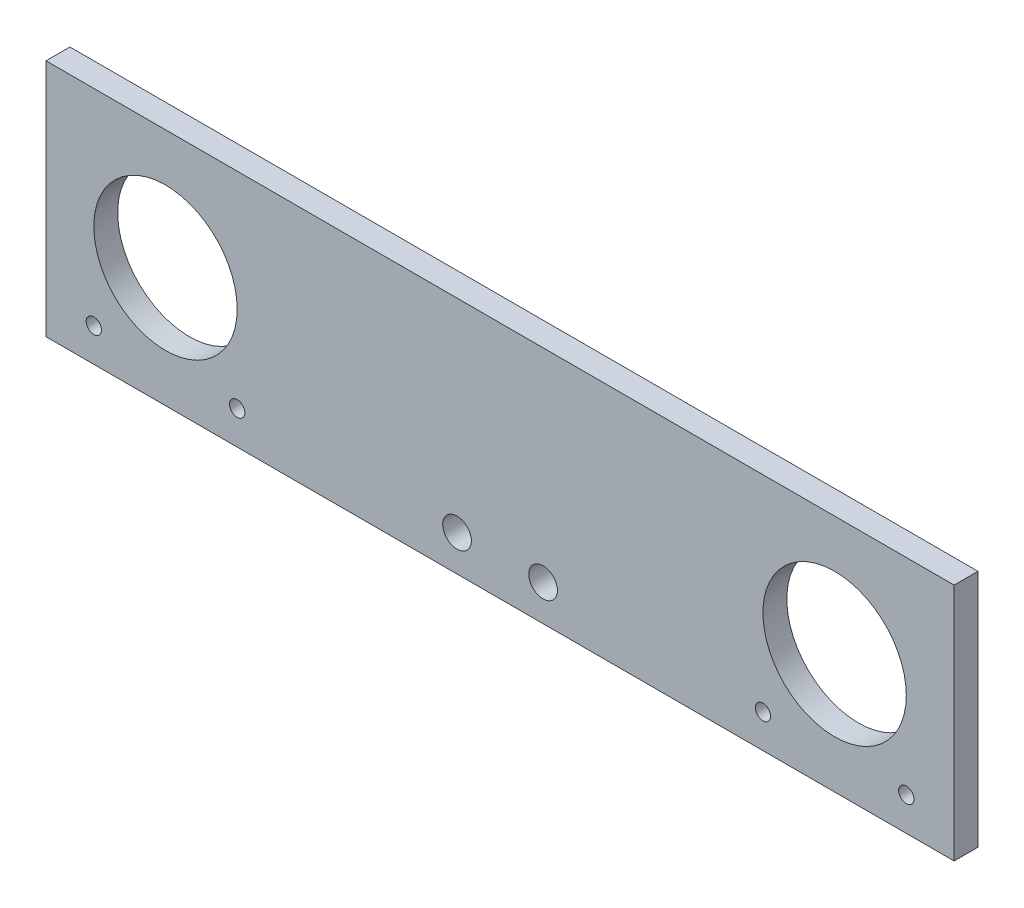
ISO-10303-21;
HEADER;
FILE_DESCRIPTION(('STEP AP214'),'2;1');
FILE_NAME('part.step','',(''),(''),'','','');
FILE_SCHEMA(('AUTOMOTIVE_DESIGN { 1 0 10303 214 1 1 1 1 }'));
ENDSEC;
DATA;
#1=APPLICATION_CONTEXT('core data for automotive mechanical design processes');
#2=APPLICATION_PROTOCOL_DEFINITION('international standard','automotive_design',2000,#1);
#3=PRODUCT_CONTEXT('',#1,'mechanical');
#4=PRODUCT('Part','Part','',(#3));
#5=PRODUCT_RELATED_PRODUCT_CATEGORY('part','',(#4));
#6=PRODUCT_DEFINITION_FORMATION('','',#4);
#7=PRODUCT_DEFINITION_CONTEXT('part definition',#1,'design');
#8=PRODUCT_DEFINITION('design','',#6,#7);
#9=PRODUCT_DEFINITION_SHAPE('','',#8);
#10=(LENGTH_UNIT() NAMED_UNIT(*) SI_UNIT(.MILLI.,.METRE.));
#11=(NAMED_UNIT(*) PLANE_ANGLE_UNIT() SI_UNIT($,.RADIAN.));
#12=(NAMED_UNIT(*) SI_UNIT($,.STERADIAN.) SOLID_ANGLE_UNIT());
#13=UNCERTAINTY_MEASURE_WITH_UNIT(LENGTH_MEASURE(1.E-05),#10,'distance_accuracy_value','');
#14=(GEOMETRIC_REPRESENTATION_CONTEXT(3) GLOBAL_UNCERTAINTY_ASSIGNED_CONTEXT((#13)) GLOBAL_UNIT_ASSIGNED_CONTEXT((#10,
#11,#12)) REPRESENTATION_CONTEXT('',''));
#15=CARTESIAN_POINT('',(0.,0.,0.));
#16=DIRECTION('',(0.,0.,1.));
#17=DIRECTION('',(1.,0.,0.));
#18=AXIS2_PLACEMENT_3D('',#15,#16,#17);
#19=CARTESIAN_POINT('',(0.,0.,5.));
#20=DIRECTION('',(0.,1.,0.));
#21=DIRECTION('',(0.,0.,1.));
#22=AXIS2_PLACEMENT_3D('',#19,#20,#21);
#23=PLANE('',#22);
#24=DIRECTION('',(1.,0.,0.));
#25=VECTOR('',#24,1.);
#26=CARTESIAN_POINT('',(0.,0.,0.));
#27=LINE('',#26,#25);
#28=CARTESIAN_POINT('',(0.,0.,0.));
#29=VERTEX_POINT('',#28);
#30=CARTESIAN_POINT('',(190.,0.,0.));
#31=VERTEX_POINT('',#30);
#32=EDGE_CURVE('E124',#29,#31,#27,.T.);
#33=ORIENTED_EDGE('',*,*,#32,.T.);
#34=DIRECTION('',(0.,0.,-1.));
#35=VECTOR('',#34,1.);
#36=CARTESIAN_POINT('',(190.,0.,5.));
#37=LINE('',#36,#35);
#38=CARTESIAN_POINT('',(190.,0.,5.));
#39=VERTEX_POINT('',#38);
#40=EDGE_CURVE('E11',#39,#31,#37,.T.);
#41=ORIENTED_EDGE('',*,*,#40,.F.);
#42=DIRECTION('',(1.,0.,0.));
#43=VECTOR('',#42,1.);
#44=CARTESIAN_POINT('',(0.,0.,5.));
#45=LINE('',#44,#43);
#46=CARTESIAN_POINT('',(0.,0.,5.));
#47=VERTEX_POINT('',#46);
#48=EDGE_CURVE('E86',#47,#39,#45,.T.);
#49=ORIENTED_EDGE('',*,*,#48,.F.);
#50=DIRECTION('',(0.,0.,-1.));
#51=VECTOR('',#50,1.);
#52=CARTESIAN_POINT('',(0.,0.,5.));
#53=LINE('',#52,#51);
#54=EDGE_CURVE('E53',#47,#29,#53,.T.);
#55=ORIENTED_EDGE('',*,*,#54,.T.);
#56=EDGE_LOOP('',(#33,#41,#49,#55));
#57=FACE_BOUND('',#56,.T.);
#58=ADVANCED_FACE('F36',(#57),#23,.F.);
#59=CARTESIAN_POINT('',(190.,0.,5.));
#60=DIRECTION('',(-1.,0.,0.));
#61=DIRECTION('',(0.,0.,1.));
#62=AXIS2_PLACEMENT_3D('',#59,#60,#61);
#63=PLANE('',#62);
#64=DIRECTION('',(0.,1.,0.));
#65=VECTOR('',#64,1.);
#66=CARTESIAN_POINT('',(190.,0.,0.));
#67=LINE('',#66,#65);
#68=CARTESIAN_POINT('',(190.,50.,0.));
#69=VERTEX_POINT('',#68);
#70=EDGE_CURVE('E91',#31,#69,#67,.T.);
#71=ORIENTED_EDGE('',*,*,#70,.T.);
#72=DIRECTION('',(0.,0.,-1.));
#73=VECTOR('',#72,1.);
#74=CARTESIAN_POINT('',(190.,50.,5.));
#75=LINE('',#74,#73);
#76=CARTESIAN_POINT('',(190.,50.,5.));
#77=VERTEX_POINT('',#76);
#78=EDGE_CURVE('E45',#77,#69,#75,.T.);
#79=ORIENTED_EDGE('',*,*,#78,.F.);
#80=DIRECTION('',(0.,1.,0.));
#81=VECTOR('',#80,1.);
#82=CARTESIAN_POINT('',(190.,0.,5.));
#83=LINE('',#82,#81);
#84=EDGE_CURVE('E78',#39,#77,#83,.T.);
#85=ORIENTED_EDGE('',*,*,#84,.F.);
#86=ORIENTED_EDGE('',*,*,#40,.T.);
#87=EDGE_LOOP('',(#71,#79,#85,#86));
#88=FACE_BOUND('',#87,.T.);
#89=ADVANCED_FACE('F90',(#88),#63,.F.);
#90=CARTESIAN_POINT('',(0.,50.,5.));
#91=DIRECTION('',(0.,1.,0.));
#92=DIRECTION('',(-1.,0.,0.));
#93=AXIS2_PLACEMENT_3D('',#90,#91,#92);
#94=PLANE('',#93);
#95=DIRECTION('',(1.,0.,0.));
#96=VECTOR('',#95,1.);
#97=CARTESIAN_POINT('',(0.,50.,0.));
#98=LINE('',#97,#96);
#99=CARTESIAN_POINT('',(0.,50.,0.));
#100=VERTEX_POINT('',#99);
#101=EDGE_CURVE('E127',#100,#69,#98,.T.);
#102=ORIENTED_EDGE('',*,*,#101,.F.);
#103=DIRECTION('',(0.,0.,-1.));
#104=VECTOR('',#103,1.);
#105=CARTESIAN_POINT('',(0.,50.,5.));
#106=LINE('',#105,#104);
#107=CARTESIAN_POINT('',(0.,50.,5.));
#108=VERTEX_POINT('',#107);
#109=EDGE_CURVE('E67',#108,#100,#106,.T.);
#110=ORIENTED_EDGE('',*,*,#109,.F.);
#111=DIRECTION('',(1.,0.,0.));
#112=VECTOR('',#111,1.);
#113=CARTESIAN_POINT('',(0.,50.,5.));
#114=LINE('',#113,#112);
#115=EDGE_CURVE('E85',#108,#77,#114,.T.);
#116=ORIENTED_EDGE('',*,*,#115,.T.);
#117=ORIENTED_EDGE('',*,*,#78,.T.);
#118=EDGE_LOOP('',(#102,#110,#116,#117));
#119=FACE_BOUND('',#118,.T.);
#120=ADVANCED_FACE('F94',(#119),#94,.T.);
#121=CARTESIAN_POINT('',(25.,25.,5.));
#122=DIRECTION('',(0.,0.,-1.));
#123=DIRECTION('',(-1.,0.,0.));
#124=AXIS2_PLACEMENT_3D('',#121,#122,#123);
#125=CYLINDRICAL_SURFACE('',#124,15.);
#126=CARTESIAN_POINT('',(25.,25.,5.));
#127=DIRECTION('',(0.,0.,1.));
#128=DIRECTION('',(1.,0.,0.));
#129=AXIS2_PLACEMENT_3D('',#126,#127,#128);
#130=CIRCLE('',#129,15.);
#131=CARTESIAN_POINT('',(40.,25.,5.));
#132=VERTEX_POINT('',#131);
#133=EDGE_CURVE('E158',#132,#132,#130,.T.);
#134=ORIENTED_EDGE('',*,*,#133,.T.);
#135=EDGE_LOOP('',(#134));
#136=FACE_BOUND('',#135,.T.);
#137=CARTESIAN_POINT('',(25.,25.,0.));
#138=DIRECTION('',(0.,0.,1.));
#139=DIRECTION('',(1.,0.,0.));
#140=AXIS2_PLACEMENT_3D('',#137,#138,#139);
#141=CIRCLE('',#140,15.);
#142=CARTESIAN_POINT('',(40.,25.,0.));
#143=VERTEX_POINT('',#142);
#144=EDGE_CURVE('E121',#143,#143,#141,.T.);
#145=ORIENTED_EDGE('',*,*,#144,.F.);
#146=EDGE_LOOP('',(#145));
#147=FACE_BOUND('',#146,.T.);
#148=ADVANCED_FACE('F162',(#136,#147),#125,.F.);
#149=CARTESIAN_POINT('',(165.,25.,5.));
#150=DIRECTION('',(0.,0.,-1.));
#151=DIRECTION('',(-1.,0.,0.));
#152=AXIS2_PLACEMENT_3D('',#149,#150,#151);
#153=CYLINDRICAL_SURFACE('',#152,15.);
#154=CARTESIAN_POINT('',(165.,25.,5.));
#155=DIRECTION('',(0.,0.,1.));
#156=DIRECTION('',(1.,0.,0.));
#157=AXIS2_PLACEMENT_3D('',#154,#155,#156);
#158=CIRCLE('',#157,15.);
#159=CARTESIAN_POINT('',(180.,25.,5.));
#160=VERTEX_POINT('',#159);
#161=EDGE_CURVE('E155',#160,#160,#158,.T.);
#162=ORIENTED_EDGE('',*,*,#161,.T.);
#163=EDGE_LOOP('',(#162));
#164=FACE_BOUND('',#163,.T.);
#165=CARTESIAN_POINT('',(165.,25.,0.));
#166=DIRECTION('',(0.,0.,1.));
#167=DIRECTION('',(1.,0.,0.));
#168=AXIS2_PLACEMENT_3D('',#165,#166,#167);
#169=CIRCLE('',#168,15.);
#170=CARTESIAN_POINT('',(180.,25.,0.));
#171=VERTEX_POINT('',#170);
#172=EDGE_CURVE('E118',#171,#171,#169,.T.);
#173=ORIENTED_EDGE('',*,*,#172,.F.);
#174=EDGE_LOOP('',(#173));
#175=FACE_BOUND('',#174,.T.);
#176=ADVANCED_FACE('F188',(#164,#175),#153,.F.);
#177=CARTESIAN_POINT('',(40.,7.,5.));
#178=DIRECTION('',(0.,0.,-1.));
#179=DIRECTION('',(-1.,0.,0.));
#180=AXIS2_PLACEMENT_3D('',#177,#178,#179);
#181=CYLINDRICAL_SURFACE('',#180,1.6);
#182=CARTESIAN_POINT('',(40.,7.,5.));
#183=DIRECTION('',(0.,0.,1.));
#184=DIRECTION('',(1.,0.,0.));
#185=AXIS2_PLACEMENT_3D('',#182,#183,#184);
#186=CIRCLE('',#185,1.6);
#187=CARTESIAN_POINT('',(41.6,7.,5.));
#188=VERTEX_POINT('',#187);
#189=EDGE_CURVE('E152',#188,#188,#186,.T.);
#190=ORIENTED_EDGE('',*,*,#189,.T.);
#191=EDGE_LOOP('',(#190));
#192=FACE_BOUND('',#191,.T.);
#193=CARTESIAN_POINT('',(40.,7.,0.));
#194=DIRECTION('',(0.,0.,1.));
#195=DIRECTION('',(1.,0.,0.));
#196=AXIS2_PLACEMENT_3D('',#193,#194,#195);
#197=CIRCLE('',#196,1.6);
#198=CARTESIAN_POINT('',(41.6,7.,0.));
#199=VERTEX_POINT('',#198);
#200=EDGE_CURVE('E115',#199,#199,#197,.T.);
#201=ORIENTED_EDGE('',*,*,#200,.F.);
#202=EDGE_LOOP('',(#201));
#203=FACE_BOUND('',#202,.T.);
#204=ADVANCED_FACE('F191',(#192,#203),#181,.F.);
#205=CARTESIAN_POINT('',(180.,7.,5.));
#206=DIRECTION('',(0.,0.,-1.));
#207=DIRECTION('',(-1.,0.,0.));
#208=AXIS2_PLACEMENT_3D('',#205,#206,#207);
#209=CYLINDRICAL_SURFACE('',#208,1.59999999999999);
#210=CARTESIAN_POINT('',(180.,7.,5.));
#211=DIRECTION('',(0.,0.,1.));
#212=DIRECTION('',(1.,0.,0.));
#213=AXIS2_PLACEMENT_3D('',#210,#211,#212);
#214=CIRCLE('',#213,1.59999999999999);
#215=CARTESIAN_POINT('',(181.6,7.,5.));
#216=VERTEX_POINT('',#215);
#217=EDGE_CURVE('E149',#216,#216,#214,.T.);
#218=ORIENTED_EDGE('',*,*,#217,.T.);
#219=EDGE_LOOP('',(#218));
#220=FACE_BOUND('',#219,.T.);
#221=CARTESIAN_POINT('',(180.,7.,0.));
#222=DIRECTION('',(0.,0.,1.));
#223=DIRECTION('',(1.,0.,0.));
#224=AXIS2_PLACEMENT_3D('',#221,#222,#223);
#225=CIRCLE('',#224,1.59999999999999);
#226=CARTESIAN_POINT('',(181.6,7.,0.));
#227=VERTEX_POINT('',#226);
#228=EDGE_CURVE('E112',#227,#227,#225,.T.);
#229=ORIENTED_EDGE('',*,*,#228,.F.);
#230=EDGE_LOOP('',(#229));
#231=FACE_BOUND('',#230,.T.);
#232=ADVANCED_FACE('F195',(#220,#231),#209,.F.);
#233=CARTESIAN_POINT('',(150.,7.,5.));
#234=DIRECTION('',(0.,0.,-1.));
#235=DIRECTION('',(-1.,0.,0.));
#236=AXIS2_PLACEMENT_3D('',#233,#234,#235);
#237=CYLINDRICAL_SURFACE('',#236,1.59999999999999);
#238=CARTESIAN_POINT('',(150.,7.,5.));
#239=DIRECTION('',(0.,0.,1.));
#240=DIRECTION('',(1.,0.,0.));
#241=AXIS2_PLACEMENT_3D('',#238,#239,#240);
#242=CIRCLE('',#241,1.59999999999999);
#243=CARTESIAN_POINT('',(151.6,7.,5.));
#244=VERTEX_POINT('',#243);
#245=EDGE_CURVE('E146',#244,#244,#242,.T.);
#246=ORIENTED_EDGE('',*,*,#245,.T.);
#247=EDGE_LOOP('',(#246));
#248=FACE_BOUND('',#247,.T.);
#249=CARTESIAN_POINT('',(150.,7.,0.));
#250=DIRECTION('',(0.,0.,1.));
#251=DIRECTION('',(1.,0.,0.));
#252=AXIS2_PLACEMENT_3D('',#249,#250,#251);
#253=CIRCLE('',#252,1.59999999999999);
#254=CARTESIAN_POINT('',(151.6,7.,0.));
#255=VERTEX_POINT('',#254);
#256=EDGE_CURVE('E109',#255,#255,#253,.T.);
#257=ORIENTED_EDGE('',*,*,#256,.F.);
#258=EDGE_LOOP('',(#257));
#259=FACE_BOUND('',#258,.T.);
#260=ADVANCED_FACE('F199',(#248,#259),#237,.F.);
#261=CARTESIAN_POINT('',(10.,7.,5.));
#262=DIRECTION('',(0.,0.,-1.));
#263=DIRECTION('',(-1.,0.,0.));
#264=AXIS2_PLACEMENT_3D('',#261,#262,#263);
#265=CYLINDRICAL_SURFACE('',#264,1.6);
#266=CARTESIAN_POINT('',(10.,7.,5.));
#267=DIRECTION('',(0.,0.,1.));
#268=DIRECTION('',(1.,0.,0.));
#269=AXIS2_PLACEMENT_3D('',#266,#267,#268);
#270=CIRCLE('',#269,1.6);
#271=CARTESIAN_POINT('',(11.6,7.,5.));
#272=VERTEX_POINT('',#271);
#273=EDGE_CURVE('E141',#272,#272,#270,.T.);
#274=ORIENTED_EDGE('',*,*,#273,.T.);
#275=EDGE_LOOP('',(#274));
#276=FACE_BOUND('',#275,.T.);
#277=CARTESIAN_POINT('',(10.,7.,0.));
#278=DIRECTION('',(0.,0.,1.));
#279=DIRECTION('',(1.,0.,0.));
#280=AXIS2_PLACEMENT_3D('',#277,#278,#279);
#281=CIRCLE('',#280,1.6);
#282=CARTESIAN_POINT('',(11.6,7.,0.));
#283=VERTEX_POINT('',#282);
#284=EDGE_CURVE('E106',#283,#283,#281,.T.);
#285=ORIENTED_EDGE('',*,*,#284,.F.);
#286=EDGE_LOOP('',(#285));
#287=FACE_BOUND('',#286,.T.);
#288=ADVANCED_FACE('F203',(#276,#287),#265,.F.);
#289=CARTESIAN_POINT('',(86.,7.5,5.));
#290=DIRECTION('',(0.,0.,-1.));
#291=DIRECTION('',(-1.,0.,0.));
#292=AXIS2_PLACEMENT_3D('',#289,#290,#291);
#293=CYLINDRICAL_SURFACE('',#292,3.00000000000001);
#294=CARTESIAN_POINT('',(86.,7.5,5.));
#295=DIRECTION('',(0.,0.,1.));
#296=DIRECTION('',(1.,0.,0.));
#297=AXIS2_PLACEMENT_3D('',#294,#295,#296);
#298=CIRCLE('',#297,3.00000000000001);
#299=CARTESIAN_POINT('',(89.,7.5,5.));
#300=VERTEX_POINT('',#299);
#301=EDGE_CURVE('E136',#300,#300,#298,.T.);
#302=ORIENTED_EDGE('',*,*,#301,.T.);
#303=EDGE_LOOP('',(#302));
#304=FACE_BOUND('',#303,.T.);
#305=CARTESIAN_POINT('',(86.,7.5,0.));
#306=DIRECTION('',(0.,0.,1.));
#307=DIRECTION('',(1.,0.,0.));
#308=AXIS2_PLACEMENT_3D('',#305,#306,#307);
#309=CIRCLE('',#308,3.00000000000001);
#310=CARTESIAN_POINT('',(89.,7.5,0.));
#311=VERTEX_POINT('',#310);
#312=EDGE_CURVE('E103',#311,#311,#309,.T.);
#313=ORIENTED_EDGE('',*,*,#312,.F.);
#314=EDGE_LOOP('',(#313));
#315=FACE_BOUND('',#314,.T.);
#316=ADVANCED_FACE('F206',(#304,#315),#293,.F.);
#317=CARTESIAN_POINT('',(104.,7.5,5.));
#318=DIRECTION('',(0.,0.,-1.));
#319=DIRECTION('',(-1.,0.,0.));
#320=AXIS2_PLACEMENT_3D('',#317,#318,#319);
#321=CYLINDRICAL_SURFACE('',#320,3.00000000000001);
#322=CARTESIAN_POINT('',(104.,7.5,5.));
#323=DIRECTION('',(0.,0.,1.));
#324=DIRECTION('',(1.,0.,0.));
#325=AXIS2_PLACEMENT_3D('',#322,#323,#324);
#326=CIRCLE('',#325,3.00000000000001);
#327=CARTESIAN_POINT('',(107.,7.5,5.));
#328=VERTEX_POINT('',#327);
#329=EDGE_CURVE('E132',#328,#328,#326,.T.);
#330=ORIENTED_EDGE('',*,*,#329,.T.);
#331=EDGE_LOOP('',(#330));
#332=FACE_BOUND('',#331,.T.);
#333=CARTESIAN_POINT('',(104.,7.5,0.));
#334=DIRECTION('',(0.,0.,1.));
#335=DIRECTION('',(1.,0.,0.));
#336=AXIS2_PLACEMENT_3D('',#333,#334,#335);
#337=CIRCLE('',#336,3.00000000000001);
#338=CARTESIAN_POINT('',(107.,7.5,0.));
#339=VERTEX_POINT('',#338);
#340=EDGE_CURVE('E100',#339,#339,#337,.T.);
#341=ORIENTED_EDGE('',*,*,#340,.F.);
#342=EDGE_LOOP('',(#341));
#343=FACE_BOUND('',#342,.T.);
#344=ADVANCED_FACE('F38',(#332,#343),#321,.F.);
#345=CARTESIAN_POINT('',(0.,0.,5.));
#346=DIRECTION('',(-1.,0.,0.));
#347=DIRECTION('',(0.,0.,1.));
#348=AXIS2_PLACEMENT_3D('',#345,#346,#347);
#349=PLANE('',#348);
#350=DIRECTION('',(0.,1.,0.));
#351=VECTOR('',#350,1.);
#352=CARTESIAN_POINT('',(0.,0.,0.));
#353=LINE('',#352,#351);
#354=EDGE_CURVE('E129',#29,#100,#353,.T.);
#355=ORIENTED_EDGE('',*,*,#354,.F.);
#356=ORIENTED_EDGE('',*,*,#54,.F.);
#357=DIRECTION('',(0.,1.,0.));
#358=VECTOR('',#357,1.);
#359=CARTESIAN_POINT('',(0.,0.,5.));
#360=LINE('',#359,#358);
#361=EDGE_CURVE('E95',#47,#108,#360,.T.);
#362=ORIENTED_EDGE('',*,*,#361,.T.);
#363=ORIENTED_EDGE('',*,*,#109,.T.);
#364=EDGE_LOOP('',(#355,#356,#362,#363));
#365=FACE_BOUND('',#364,.T.);
#366=ADVANCED_FACE('F167',(#365),#349,.T.);
#367=CARTESIAN_POINT('',(0.,0.,5.));
#368=DIRECTION('',(0.,0.,1.));
#369=DIRECTION('',(1.,0.,0.));
#370=AXIS2_PLACEMENT_3D('',#367,#368,#369);
#371=PLANE('',#370);
#372=ORIENTED_EDGE('',*,*,#329,.F.);
#373=EDGE_LOOP('',(#372));
#374=FACE_BOUND('',#373,.T.);
#375=ORIENTED_EDGE('',*,*,#301,.F.);
#376=EDGE_LOOP('',(#375));
#377=FACE_BOUND('',#376,.T.);
#378=ORIENTED_EDGE('',*,*,#273,.F.);
#379=EDGE_LOOP('',(#378));
#380=FACE_BOUND('',#379,.T.);
#381=ORIENTED_EDGE('',*,*,#245,.F.);
#382=EDGE_LOOP('',(#381));
#383=FACE_BOUND('',#382,.T.);
#384=ORIENTED_EDGE('',*,*,#217,.F.);
#385=EDGE_LOOP('',(#384));
#386=FACE_BOUND('',#385,.T.);
#387=ORIENTED_EDGE('',*,*,#189,.F.);
#388=EDGE_LOOP('',(#387));
#389=FACE_BOUND('',#388,.T.);
#390=ORIENTED_EDGE('',*,*,#161,.F.);
#391=EDGE_LOOP('',(#390));
#392=FACE_BOUND('',#391,.T.);
#393=ORIENTED_EDGE('',*,*,#133,.F.);
#394=EDGE_LOOP('',(#393));
#395=FACE_BOUND('',#394,.T.);
#396=ORIENTED_EDGE('',*,*,#48,.T.);
#397=ORIENTED_EDGE('',*,*,#84,.T.);
#398=ORIENTED_EDGE('',*,*,#115,.F.);
#399=ORIENTED_EDGE('',*,*,#361,.F.);
#400=EDGE_LOOP('',(#396,#397,#398,#399));
#401=FACE_BOUND('',#400,.T.);
#402=ADVANCED_FACE('F82',(#374,#377,#380,#383,#386,#389,#392,#395,#401),#371,.T.);
#403=CARTESIAN_POINT('',(0.,0.,0.));
#404=DIRECTION('',(0.,0.,1.));
#405=DIRECTION('',(1.,0.,0.));
#406=AXIS2_PLACEMENT_3D('',#403,#404,#405);
#407=PLANE('',#406);
#408=ORIENTED_EDGE('',*,*,#340,.T.);
#409=EDGE_LOOP('',(#408));
#410=FACE_BOUND('',#409,.T.);
#411=ORIENTED_EDGE('',*,*,#312,.T.);
#412=EDGE_LOOP('',(#411));
#413=FACE_BOUND('',#412,.T.);
#414=ORIENTED_EDGE('',*,*,#284,.T.);
#415=EDGE_LOOP('',(#414));
#416=FACE_BOUND('',#415,.T.);
#417=ORIENTED_EDGE('',*,*,#256,.T.);
#418=EDGE_LOOP('',(#417));
#419=FACE_BOUND('',#418,.T.);
#420=ORIENTED_EDGE('',*,*,#228,.T.);
#421=EDGE_LOOP('',(#420));
#422=FACE_BOUND('',#421,.T.);
#423=ORIENTED_EDGE('',*,*,#200,.T.);
#424=EDGE_LOOP('',(#423));
#425=FACE_BOUND('',#424,.T.);
#426=ORIENTED_EDGE('',*,*,#172,.T.);
#427=EDGE_LOOP('',(#426));
#428=FACE_BOUND('',#427,.T.);
#429=ORIENTED_EDGE('',*,*,#144,.T.);
#430=EDGE_LOOP('',(#429));
#431=FACE_BOUND('',#430,.T.);
#432=ORIENTED_EDGE('',*,*,#32,.F.);
#433=ORIENTED_EDGE('',*,*,#354,.T.);
#434=ORIENTED_EDGE('',*,*,#101,.T.);
#435=ORIENTED_EDGE('',*,*,#70,.F.);
#436=EDGE_LOOP('',(#432,#433,#434,#435));
#437=FACE_BOUND('',#436,.T.);
#438=ADVANCED_FACE('F166',(#410,#413,#416,#419,#422,#425,#428,#431,#437),#407,.F.);
#439=CLOSED_SHELL('',(#58,#89,#120,#148,#176,#204,#232,#260,#288,#316,#344,#366,#402,#438));
#440=MANIFOLD_SOLID_BREP('B2',#439);
#441=ADVANCED_BREP_SHAPE_REPRESENTATION('',(#18,#440),#14);
#442=SHAPE_DEFINITION_REPRESENTATION(#9,#441);
ENDSEC;
END-ISO-10303-21;
